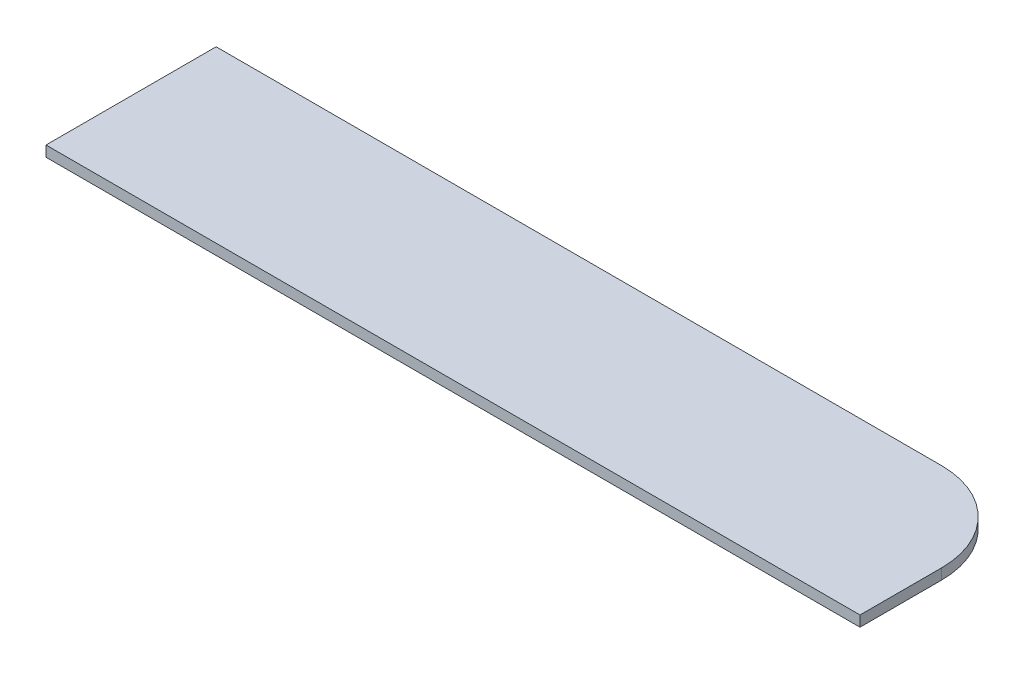
ISO-10303-21;
HEADER;
FILE_DESCRIPTION(('STEP AP214'),'2;1');
FILE_NAME('part.step','',(''),(''),'','','');
FILE_SCHEMA(('AUTOMOTIVE_DESIGN { 1 0 10303 214 1 1 1 1 }'));
ENDSEC;
DATA;
#1=APPLICATION_CONTEXT('core data for automotive mechanical design processes');
#2=APPLICATION_PROTOCOL_DEFINITION('international standard','automotive_design',2000,#1);
#3=PRODUCT_CONTEXT('',#1,'mechanical');
#4=PRODUCT('Part','Part','',(#3));
#5=PRODUCT_RELATED_PRODUCT_CATEGORY('part','',(#4));
#6=PRODUCT_DEFINITION_FORMATION('','',#4);
#7=PRODUCT_DEFINITION_CONTEXT('part definition',#1,'design');
#8=PRODUCT_DEFINITION('design','',#6,#7);
#9=PRODUCT_DEFINITION_SHAPE('','',#8);
#10=(LENGTH_UNIT() NAMED_UNIT(*) SI_UNIT(.MILLI.,.METRE.));
#11=(NAMED_UNIT(*) PLANE_ANGLE_UNIT() SI_UNIT($,.RADIAN.));
#12=(NAMED_UNIT(*) SI_UNIT($,.STERADIAN.) SOLID_ANGLE_UNIT());
#13=UNCERTAINTY_MEASURE_WITH_UNIT(LENGTH_MEASURE(1.E-05),#10,'distance_accuracy_value','');
#14=(GEOMETRIC_REPRESENTATION_CONTEXT(3) GLOBAL_UNCERTAINTY_ASSIGNED_CONTEXT((#13)) GLOBAL_UNIT_ASSIGNED_CONTEXT((#10,
#11,#12)) REPRESENTATION_CONTEXT('',''));
#15=CARTESIAN_POINT('',(0.,0.,0.));
#16=DIRECTION('',(0.,0.,1.));
#17=DIRECTION('',(1.,0.,0.));
#18=AXIS2_PLACEMENT_3D('',#15,#16,#17);
#19=CARTESIAN_POINT('',(-689.,18.,144.));
#20=DIRECTION('',(1.,0.,0.));
#21=DIRECTION('',(0.,0.,-1.));
#22=AXIS2_PLACEMENT_3D('',#19,#20,#21);
#23=PLANE('',#22);
#24=DIRECTION('',(0.,0.,1.));
#25=VECTOR('',#24,1.);
#26=CARTESIAN_POINT('',(-689.,0.,144.));
#27=LINE('',#26,#25);
#28=CARTESIAN_POINT('',(-689.,0.,-144.));
#29=VERTEX_POINT('',#28);
#30=CARTESIAN_POINT('',(-689.,0.,144.));
#31=VERTEX_POINT('',#30);
#32=EDGE_CURVE('E107',#29,#31,#27,.T.);
#33=ORIENTED_EDGE('',*,*,#32,.T.);
#34=DIRECTION('',(0.,-1.,0.));
#35=VECTOR('',#34,1.);
#36=CARTESIAN_POINT('',(-689.,18.,144.));
#37=LINE('',#36,#35);
#38=CARTESIAN_POINT('',(-689.,18.,144.));
#39=VERTEX_POINT('',#38);
#40=EDGE_CURVE('E11',#39,#31,#37,.T.);
#41=ORIENTED_EDGE('',*,*,#40,.F.);
#42=DIRECTION('',(0.,0.,1.));
#43=VECTOR('',#42,1.);
#44=CARTESIAN_POINT('',(-689.,18.,144.));
#45=LINE('',#44,#43);
#46=CARTESIAN_POINT('',(-689.,18.,-144.));
#47=VERTEX_POINT('',#46);
#48=EDGE_CURVE('E115',#47,#39,#45,.T.);
#49=ORIENTED_EDGE('',*,*,#48,.F.);
#50=DIRECTION('',(0.,-1.,0.));
#51=VECTOR('',#50,1.);
#52=CARTESIAN_POINT('',(-689.,18.,-144.));
#53=LINE('',#52,#51);
#54=EDGE_CURVE('E103',#47,#29,#53,.T.);
#55=ORIENTED_EDGE('',*,*,#54,.T.);
#56=EDGE_LOOP('',(#33,#41,#49,#55));
#57=FACE_BOUND('',#56,.T.);
#58=ADVANCED_FACE('F33',(#57),#23,.F.);
#59=CARTESIAN_POINT('',(689.,18.,144.));
#60=DIRECTION('',(0.,0.,-1.));
#61=DIRECTION('',(-1.,0.,0.));
#62=AXIS2_PLACEMENT_3D('',#59,#60,#61);
#63=PLANE('',#62);
#64=DIRECTION('',(1.,0.,0.));
#65=VECTOR('',#64,1.);
#66=CARTESIAN_POINT('',(689.,0.,144.));
#67=LINE('',#66,#65);
#68=CARTESIAN_POINT('',(689.,0.,144.));
#69=VERTEX_POINT('',#68);
#70=EDGE_CURVE('E110',#31,#69,#67,.T.);
#71=ORIENTED_EDGE('',*,*,#70,.T.);
#72=DIRECTION('',(0.,-1.,0.));
#73=VECTOR('',#72,1.);
#74=CARTESIAN_POINT('',(689.,18.,144.));
#75=LINE('',#74,#73);
#76=CARTESIAN_POINT('',(689.,18.,144.));
#77=VERTEX_POINT('',#76);
#78=EDGE_CURVE('E41',#77,#69,#75,.T.);
#79=ORIENTED_EDGE('',*,*,#78,.F.);
#80=DIRECTION('',(1.,0.,0.));
#81=VECTOR('',#80,1.);
#82=CARTESIAN_POINT('',(689.,18.,144.));
#83=LINE('',#82,#81);
#84=EDGE_CURVE('E83',#39,#77,#83,.T.);
#85=ORIENTED_EDGE('',*,*,#84,.F.);
#86=ORIENTED_EDGE('',*,*,#40,.T.);
#87=EDGE_LOOP('',(#71,#79,#85,#86));
#88=FACE_BOUND('',#87,.T.);
#89=ADVANCED_FACE('F134',(#88),#63,.F.);
#90=CARTESIAN_POINT('',(689.,18.,144.));
#91=DIRECTION('',(-1.,0.,0.));
#92=DIRECTION('',(0.,0.,1.));
#93=AXIS2_PLACEMENT_3D('',#90,#91,#92);
#94=PLANE('',#93);
#95=DIRECTION('',(0.,0.,-1.));
#96=VECTOR('',#95,1.);
#97=CARTESIAN_POINT('',(689.,0.,144.));
#98=LINE('',#97,#96);
#99=CARTESIAN_POINT('',(689.,0.,5.99999999999994));
#100=VERTEX_POINT('',#99);
#101=EDGE_CURVE('E98',#69,#100,#98,.T.);
#102=ORIENTED_EDGE('',*,*,#101,.T.);
#103=DIRECTION('',(0.,-1.,0.));
#104=VECTOR('',#103,1.);
#105=CARTESIAN_POINT('',(689.,18.,5.99999999999994));
#106=LINE('',#105,#104);
#107=CARTESIAN_POINT('',(689.,18.,5.99999999999994));
#108=VERTEX_POINT('',#107);
#109=EDGE_CURVE('E95',#108,#100,#106,.T.);
#110=ORIENTED_EDGE('',*,*,#109,.F.);
#111=DIRECTION('',(0.,0.,-1.));
#112=VECTOR('',#111,1.);
#113=CARTESIAN_POINT('',(689.,18.,144.));
#114=LINE('',#113,#112);
#115=EDGE_CURVE('E87',#77,#108,#114,.T.);
#116=ORIENTED_EDGE('',*,*,#115,.F.);
#117=ORIENTED_EDGE('',*,*,#78,.T.);
#118=EDGE_LOOP('',(#102,#110,#116,#117));
#119=FACE_BOUND('',#118,.T.);
#120=ADVANCED_FACE('F96',(#119),#94,.F.);
#121=CARTESIAN_POINT('',(539.,18.,5.99999999999995));
#122=DIRECTION('',(0.,-1.,0.));
#123=DIRECTION('',(0.,0.,-1.));
#124=AXIS2_PLACEMENT_3D('',#121,#122,#123);
#125=CYLINDRICAL_SURFACE('',#124,150.);
#126=CARTESIAN_POINT('',(539.,0.,5.99999999999995));
#127=DIRECTION('',(0.,1.,0.));
#128=DIRECTION('',(0.,0.,-1.));
#129=AXIS2_PLACEMENT_3D('',#126,#127,#128);
#130=CIRCLE('',#129,150.);
#131=CARTESIAN_POINT('',(539.,0.,-144.));
#132=VERTEX_POINT('',#131);
#133=EDGE_CURVE('E69',#100,#132,#130,.T.);
#134=ORIENTED_EDGE('',*,*,#133,.T.);
#135=DIRECTION('',(0.,-1.,0.));
#136=VECTOR('',#135,1.);
#137=CARTESIAN_POINT('',(539.,18.,-144.));
#138=LINE('',#137,#136);
#139=CARTESIAN_POINT('',(539.,18.,-144.));
#140=VERTEX_POINT('',#139);
#141=EDGE_CURVE('E99',#140,#132,#138,.T.);
#142=ORIENTED_EDGE('',*,*,#141,.F.);
#143=CARTESIAN_POINT('',(539.,18.,5.99999999999995));
#144=DIRECTION('',(0.,1.,0.));
#145=DIRECTION('',(0.,0.,-1.));
#146=AXIS2_PLACEMENT_3D('',#143,#144,#145);
#147=CIRCLE('',#146,150.);
#148=EDGE_CURVE('E91',#108,#140,#147,.T.);
#149=ORIENTED_EDGE('',*,*,#148,.F.);
#150=ORIENTED_EDGE('',*,*,#109,.T.);
#151=EDGE_LOOP('',(#134,#142,#149,#150));
#152=FACE_BOUND('',#151,.T.);
#153=ADVANCED_FACE('F101',(#152),#125,.T.);
#154=CARTESIAN_POINT('',(539.,18.,-144.));
#155=DIRECTION('',(0.,0.,1.));
#156=DIRECTION('',(1.,0.,0.));
#157=AXIS2_PLACEMENT_3D('',#154,#155,#156);
#158=PLANE('',#157);
#159=DIRECTION('',(-1.,0.,0.));
#160=VECTOR('',#159,1.);
#161=CARTESIAN_POINT('',(539.,0.,-144.));
#162=LINE('',#161,#160);
#163=EDGE_CURVE('E75',#132,#29,#162,.T.);
#164=ORIENTED_EDGE('',*,*,#163,.T.);
#165=ORIENTED_EDGE('',*,*,#54,.F.);
#166=DIRECTION('',(-1.,0.,0.));
#167=VECTOR('',#166,1.);
#168=CARTESIAN_POINT('',(539.,18.,-144.));
#169=LINE('',#168,#167);
#170=EDGE_CURVE('E49',#140,#47,#169,.T.);
#171=ORIENTED_EDGE('',*,*,#170,.F.);
#172=ORIENTED_EDGE('',*,*,#141,.T.);
#173=EDGE_LOOP('',(#164,#165,#171,#172));
#174=FACE_BOUND('',#173,.T.);
#175=ADVANCED_FACE('F123',(#174),#158,.F.);
#176=CARTESIAN_POINT('',(539.,18.,5.99999999999995));
#177=DIRECTION('',(0.,-1.,0.));
#178=DIRECTION('',(0.,0.,-1.));
#179=AXIS2_PLACEMENT_3D('',#176,#177,#178);
#180=PLANE('',#179);
#181=ORIENTED_EDGE('',*,*,#48,.T.);
#182=ORIENTED_EDGE('',*,*,#84,.T.);
#183=ORIENTED_EDGE('',*,*,#115,.T.);
#184=ORIENTED_EDGE('',*,*,#148,.T.);
#185=ORIENTED_EDGE('',*,*,#170,.T.);
#186=EDGE_LOOP('',(#181,#182,#183,#184,#185));
#187=FACE_BOUND('',#186,.T.);
#188=ADVANCED_FACE('F89',(#187),#180,.F.);
#189=CARTESIAN_POINT('',(539.,0.,5.99999999999995));
#190=DIRECTION('',(0.,-1.,0.));
#191=DIRECTION('',(0.,0.,-1.));
#192=AXIS2_PLACEMENT_3D('',#189,#190,#191);
#193=PLANE('',#192);
#194=ORIENTED_EDGE('',*,*,#32,.F.);
#195=ORIENTED_EDGE('',*,*,#163,.F.);
#196=ORIENTED_EDGE('',*,*,#133,.F.);
#197=ORIENTED_EDGE('',*,*,#101,.F.);
#198=ORIENTED_EDGE('',*,*,#70,.F.);
#199=EDGE_LOOP('',(#194,#195,#196,#197,#198));
#200=FACE_BOUND('',#199,.T.);
#201=ADVANCED_FACE('F119',(#200),#193,.T.);
#202=CLOSED_SHELL('',(#58,#89,#120,#153,#175,#188,#201));
#203=MANIFOLD_SOLID_BREP('B2',#202);
#204=ADVANCED_BREP_SHAPE_REPRESENTATION('',(#18,#203),#14);
#205=SHAPE_DEFINITION_REPRESENTATION(#9,#204);
ENDSEC;
END-ISO-10303-21;
